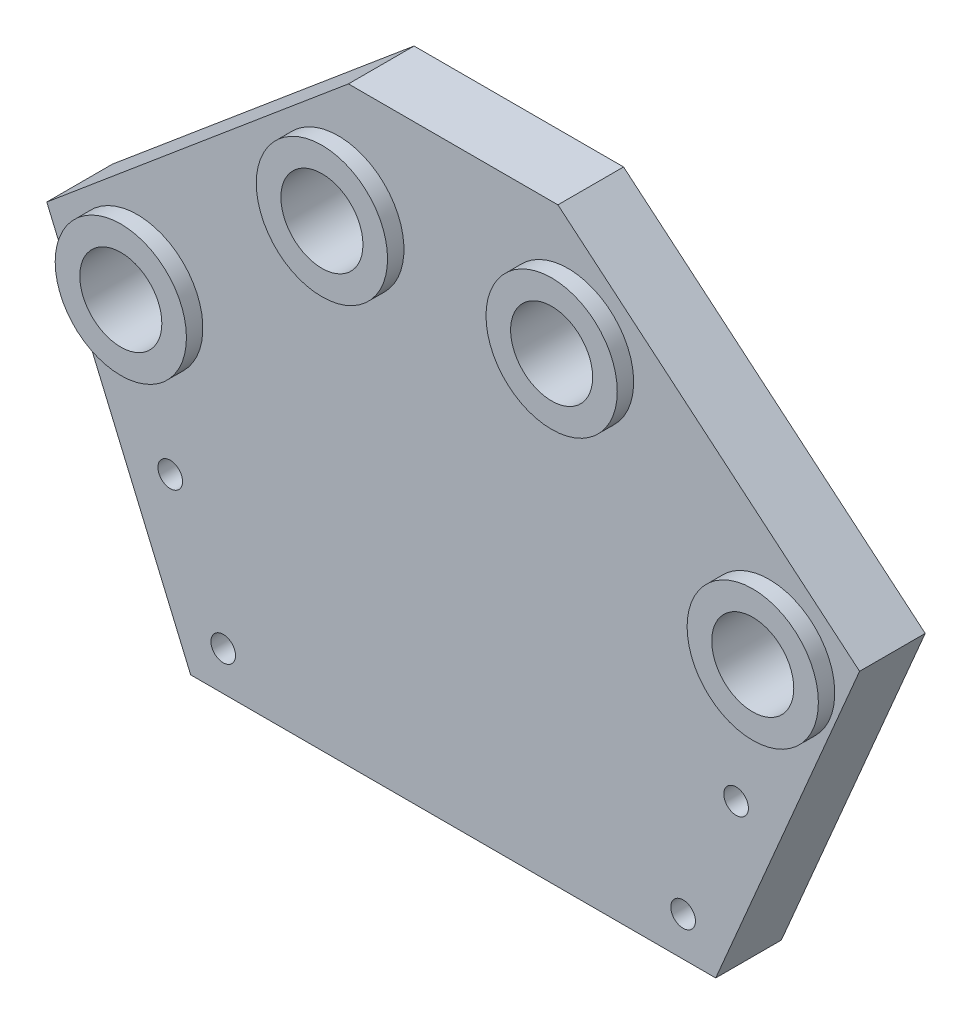
ISO-10303-21;
HEADER;
FILE_DESCRIPTION(('STEP AP214'),'2;1');
FILE_NAME('part.step','',(''),(''),'','','');
FILE_SCHEMA(('AUTOMOTIVE_DESIGN { 1 0 10303 214 1 1 1 1 }'));
ENDSEC;
DATA;
#1=APPLICATION_CONTEXT('core data for automotive mechanical design processes');
#2=APPLICATION_PROTOCOL_DEFINITION('international standard','automotive_design',2000,#1);
#3=PRODUCT_CONTEXT('',#1,'mechanical');
#4=PRODUCT('Part','Part','',(#3));
#5=PRODUCT_RELATED_PRODUCT_CATEGORY('part','',(#4));
#6=PRODUCT_DEFINITION_FORMATION('','',#4);
#7=PRODUCT_DEFINITION_CONTEXT('part definition',#1,'design');
#8=PRODUCT_DEFINITION('design','',#6,#7);
#9=PRODUCT_DEFINITION_SHAPE('','',#8);
#10=(LENGTH_UNIT() NAMED_UNIT(*) SI_UNIT(.MILLI.,.METRE.));
#11=(NAMED_UNIT(*) PLANE_ANGLE_UNIT() SI_UNIT($,.RADIAN.));
#12=(NAMED_UNIT(*) SI_UNIT($,.STERADIAN.) SOLID_ANGLE_UNIT());
#13=UNCERTAINTY_MEASURE_WITH_UNIT(LENGTH_MEASURE(1.E-05),#10,'distance_accuracy_value','');
#14=(GEOMETRIC_REPRESENTATION_CONTEXT(3) GLOBAL_UNCERTAINTY_ASSIGNED_CONTEXT((#13)) GLOBAL_UNIT_ASSIGNED_CONTEXT((#10,
#11,#12)) REPRESENTATION_CONTEXT('',''));
#15=CARTESIAN_POINT('',(0.,0.,0.));
#16=DIRECTION('',(0.,0.,1.));
#17=DIRECTION('',(1.,0.,0.));
#18=AXIS2_PLACEMENT_3D('',#15,#16,#17);
#19=CARTESIAN_POINT('',(0.,0.,6.35));
#20=DIRECTION('',(0.,0.,-1.));
#21=DIRECTION('',(-1.,0.,0.));
#22=AXIS2_PLACEMENT_3D('',#19,#20,#21);
#23=PLANE('',#22);
#24=CARTESIAN_POINT('',(-30.5700288552221,29.6405902948182,6.35));
#25=DIRECTION('',(0.,0.,-1.));
#26=DIRECTION('',(-1.,0.,0.));
#27=AXIS2_PLACEMENT_3D('',#24,#25,#26);
#28=CIRCLE('',#27,6.35);
#29=CARTESIAN_POINT('',(-36.9200288552221,29.6405902948182,6.35));
#30=VERTEX_POINT('',#29);
#31=EDGE_CURVE('E43',#30,#30,#28,.F.);
#32=ORIENTED_EDGE('',*,*,#31,.F.);
#33=EDGE_LOOP('',(#32));
#34=FACE_BOUND('',#33,.T.);
#35=CARTESIAN_POINT('',(-11.1125,45.9673955808562,6.35));
#36=DIRECTION('',(0.,0.,-1.));
#37=DIRECTION('',(-1.,0.,0.));
#38=AXIS2_PLACEMENT_3D('',#35,#36,#37);
#39=CIRCLE('',#38,6.35);
#40=CARTESIAN_POINT('',(-17.4625,45.9673955808562,6.35));
#41=VERTEX_POINT('',#40);
#42=EDGE_CURVE('E140',#41,#41,#39,.F.);
#43=ORIENTED_EDGE('',*,*,#42,.F.);
#44=EDGE_LOOP('',(#43));
#45=FACE_BOUND('',#44,.T.);
#46=CARTESIAN_POINT('',(27.374737278154,15.806737026746,6.35));
#47=DIRECTION('',(0.,0.,-1.));
#48=DIRECTION('',(-1.,0.,0.));
#49=AXIS2_PLACEMENT_3D('',#46,#47,#48);
#50=CIRCLE('',#49,1.190625);
#51=CARTESIAN_POINT('',(26.184112278154,15.806737026746,6.35));
#52=VERTEX_POINT('',#51);
#53=EDGE_CURVE('E159',#52,#52,#50,.F.);
#54=ORIENTED_EDGE('',*,*,#53,.F.);
#55=EDGE_LOOP('',(#54));
#56=FACE_BOUND('',#55,.T.);
#57=CARTESIAN_POINT('',(22.2484937336883,3.77967306906618,6.35));
#58=DIRECTION('',(0.,0.,-1.));
#59=DIRECTION('',(-1.,0.,0.));
#60=AXIS2_PLACEMENT_3D('',#57,#58,#59);
#61=CIRCLE('',#60,1.190625);
#62=CARTESIAN_POINT('',(21.0578687336883,3.77967306906618,6.35));
#63=VERTEX_POINT('',#62);
#64=EDGE_CURVE('E163',#63,#63,#61,.F.);
#65=ORIENTED_EDGE('',*,*,#64,.F.);
#66=EDGE_LOOP('',(#65));
#67=FACE_BOUND('',#66,.T.);
#68=CARTESIAN_POINT('',(-22.2484937336883,3.77967306906618,6.35));
#69=DIRECTION('',(0.,0.,-1.));
#70=DIRECTION('',(-1.,0.,0.));
#71=AXIS2_PLACEMENT_3D('',#68,#69,#70);
#72=CIRCLE('',#71,1.190625);
#73=CARTESIAN_POINT('',(-23.4391187336883,3.77967306906618,6.35));
#74=VERTEX_POINT('',#73);
#75=EDGE_CURVE('E167',#74,#74,#72,.F.);
#76=ORIENTED_EDGE('',*,*,#75,.F.);
#77=EDGE_LOOP('',(#76));
#78=FACE_BOUND('',#77,.T.);
#79=CARTESIAN_POINT('',(-27.374737278154,15.806737026746,6.35));
#80=DIRECTION('',(0.,0.,-1.));
#81=DIRECTION('',(-1.,0.,0.));
#82=AXIS2_PLACEMENT_3D('',#79,#80,#81);
#83=CIRCLE('',#82,1.190625);
#84=CARTESIAN_POINT('',(-28.565362278154,15.806737026746,6.35));
#85=VERTEX_POINT('',#84);
#86=EDGE_CURVE('E170',#85,#85,#83,.F.);
#87=ORIENTED_EDGE('',*,*,#86,.F.);
#88=EDGE_LOOP('',(#87));
#89=FACE_BOUND('',#88,.T.);
#90=DIRECTION('',(-0.766044443118982,0.642787609686535,0.));
#91=VECTOR('',#90,1.);
#92=CARTESIAN_POINT('',(39.3204421674631,32.659792070943,6.35));
#93=LINE('',#92,#91);
#94=CARTESIAN_POINT('',(39.3204421674631,32.659792070943,6.35));
#95=VERTEX_POINT('',#94);
#96=CARTESIAN_POINT('',(10.13414888463,57.15,6.35));
#97=VERTEX_POINT('',#96);
#98=EDGE_CURVE('E131',#95,#97,#93,.T.);
#99=ORIENTED_EDGE('',*,*,#98,.T.);
#100=DIRECTION('',(-1.,0.,0.));
#101=VECTOR('',#100,1.);
#102=CARTESIAN_POINT('',(10.13414888463,57.15,6.35));
#103=LINE('',#102,#101);
#104=CARTESIAN_POINT('',(-10.13414888463,57.15,6.35));
#105=VERTEX_POINT('',#104);
#106=EDGE_CURVE('E89',#97,#105,#103,.T.);
#107=ORIENTED_EDGE('',*,*,#106,.T.);
#108=DIRECTION('',(-0.766044443118982,-0.642787609686535,0.));
#109=VECTOR('',#108,1.);
#110=CARTESIAN_POINT('',(-39.3204421674631,32.659792070943,6.35));
#111=LINE('',#110,#109);
#112=CARTESIAN_POINT('',(-39.3204421674631,32.659792070943,6.35));
#113=VERTEX_POINT('',#112);
#114=EDGE_CURVE('E102',#105,#113,#111,.T.);
#115=ORIENTED_EDGE('',*,*,#114,.T.);
#116=DIRECTION('',(0.392095462422468,-0.919924534050327,0.));
#117=VECTOR('',#116,1.);
#118=CARTESIAN_POINT('',(-25.4,0.,6.35));
#119=LINE('',#118,#117);
#120=CARTESIAN_POINT('',(-25.4,0.,6.35));
#121=VERTEX_POINT('',#120);
#122=EDGE_CURVE('E96',#113,#121,#119,.T.);
#123=ORIENTED_EDGE('',*,*,#122,.T.);
#124=DIRECTION('',(1.,0.,0.));
#125=VECTOR('',#124,1.);
#126=CARTESIAN_POINT('',(-25.4,0.,6.35));
#127=LINE('',#126,#125);
#128=CARTESIAN_POINT('',(25.4,0.,6.35));
#129=VERTEX_POINT('',#128);
#130=EDGE_CURVE('E100',#121,#129,#127,.T.);
#131=ORIENTED_EDGE('',*,*,#130,.T.);
#132=DIRECTION('',(0.392095462422468,0.919924534050327,0.));
#133=VECTOR('',#132,1.);
#134=CARTESIAN_POINT('',(25.4,0.,6.35));
#135=LINE('',#134,#133);
#136=EDGE_CURVE('E51',#129,#95,#135,.T.);
#137=ORIENTED_EDGE('',*,*,#136,.T.);
#138=EDGE_LOOP('',(#99,#107,#115,#123,#131,#137));
#139=FACE_BOUND('',#138,.T.);
#140=CARTESIAN_POINT('',(11.1125,45.9673955808562,6.35));
#141=DIRECTION('',(0.,0.,-1.));
#142=DIRECTION('',(-1.,0.,0.));
#143=AXIS2_PLACEMENT_3D('',#140,#141,#142);
#144=CIRCLE('',#143,6.35);
#145=CARTESIAN_POINT('',(4.76249999999999,45.9673955808562,6.35));
#146=VERTEX_POINT('',#145);
#147=EDGE_CURVE('E143',#146,#146,#144,.F.);
#148=ORIENTED_EDGE('',*,*,#147,.F.);
#149=EDGE_LOOP('',(#148));
#150=FACE_BOUND('',#149,.T.);
#151=CARTESIAN_POINT('',(30.5700288552221,29.6405902948182,6.35));
#152=DIRECTION('',(0.,0.,-1.));
#153=DIRECTION('',(-1.,0.,0.));
#154=AXIS2_PLACEMENT_3D('',#151,#152,#153);
#155=CIRCLE('',#154,6.35);
#156=CARTESIAN_POINT('',(24.2200288552221,29.6405902948182,6.35));
#157=VERTEX_POINT('',#156);
#158=EDGE_CURVE('E11',#157,#157,#155,.F.);
#159=ORIENTED_EDGE('',*,*,#158,.F.);
#160=EDGE_LOOP('',(#159));
#161=FACE_BOUND('',#160,.T.);
#162=ADVANCED_FACE('F34',(#34,#45,#56,#67,#78,#89,#139,#150,#161),#23,.F.);
#163=CARTESIAN_POINT('',(0.,0.,0.));
#164=DIRECTION('',(0.,0.,-1.));
#165=DIRECTION('',(-1.,0.,0.));
#166=AXIS2_PLACEMENT_3D('',#163,#164,#165);
#167=PLANE('',#166);
#168=CARTESIAN_POINT('',(27.374737278154,15.806737026746,0.));
#169=DIRECTION('',(0.,0.,-1.));
#170=DIRECTION('',(-1.,0.,0.));
#171=AXIS2_PLACEMENT_3D('',#168,#169,#170);
#172=CIRCLE('',#171,1.190625);
#173=CARTESIAN_POINT('',(26.184112278154,15.806737026746,0.));
#174=VERTEX_POINT('',#173);
#175=EDGE_CURVE('E234',#174,#174,#172,.T.);
#176=ORIENTED_EDGE('',*,*,#175,.F.);
#177=EDGE_LOOP('',(#176));
#178=FACE_BOUND('',#177,.T.);
#179=CARTESIAN_POINT('',(22.2484937336883,3.77967306906618,0.));
#180=DIRECTION('',(0.,0.,-1.));
#181=DIRECTION('',(-1.,0.,0.));
#182=AXIS2_PLACEMENT_3D('',#179,#180,#181);
#183=CIRCLE('',#182,1.190625);
#184=CARTESIAN_POINT('',(21.0578687336883,3.77967306906618,0.));
#185=VERTEX_POINT('',#184);
#186=EDGE_CURVE('E238',#185,#185,#183,.T.);
#187=ORIENTED_EDGE('',*,*,#186,.F.);
#188=EDGE_LOOP('',(#187));
#189=FACE_BOUND('',#188,.T.);
#190=CARTESIAN_POINT('',(-22.2484937336883,3.77967306906618,0.));
#191=DIRECTION('',(0.,0.,-1.));
#192=DIRECTION('',(1.,0.,0.));
#193=AXIS2_PLACEMENT_3D('',#190,#191,#192);
#194=CIRCLE('',#193,1.190625);
#195=CARTESIAN_POINT('',(-21.0578687336883,3.77967306906618,0.));
#196=VERTEX_POINT('',#195);
#197=EDGE_CURVE('E172',#196,#196,#194,.T.);
#198=ORIENTED_EDGE('',*,*,#197,.F.);
#199=EDGE_LOOP('',(#198));
#200=FACE_BOUND('',#199,.T.);
#201=CARTESIAN_POINT('',(-27.374737278154,15.806737026746,0.));
#202=DIRECTION('',(0.,0.,-1.));
#203=DIRECTION('',(1.,0.,0.));
#204=AXIS2_PLACEMENT_3D('',#201,#202,#203);
#205=CIRCLE('',#204,1.190625);
#206=CARTESIAN_POINT('',(-26.184112278154,15.806737026746,0.));
#207=VERTEX_POINT('',#206);
#208=EDGE_CURVE('E173',#207,#207,#205,.T.);
#209=ORIENTED_EDGE('',*,*,#208,.F.);
#210=EDGE_LOOP('',(#209));
#211=FACE_BOUND('',#210,.T.);
#212=CARTESIAN_POINT('',(30.5700288552221,29.6405902948182,0.));
#213=DIRECTION('',(0.,0.,1.));
#214=DIRECTION('',(1.,0.,0.));
#215=AXIS2_PLACEMENT_3D('',#212,#213,#214);
#216=CIRCLE('',#215,3.96875);
#217=CARTESIAN_POINT('',(34.5387788552221,29.6405902948182,0.));
#218=VERTEX_POINT('',#217);
#219=EDGE_CURVE('E185',#218,#218,#216,.T.);
#220=ORIENTED_EDGE('',*,*,#219,.T.);
#221=EDGE_LOOP('',(#220));
#222=FACE_BOUND('',#221,.T.);
#223=CARTESIAN_POINT('',(11.1125,45.9673955808562,0.));
#224=DIRECTION('',(0.,0.,1.));
#225=DIRECTION('',(1.,0.,0.));
#226=AXIS2_PLACEMENT_3D('',#223,#224,#225);
#227=CIRCLE('',#226,3.96875);
#228=CARTESIAN_POINT('',(15.08125,45.9673955808562,0.));
#229=VERTEX_POINT('',#228);
#230=EDGE_CURVE('E124',#229,#229,#227,.T.);
#231=ORIENTED_EDGE('',*,*,#230,.T.);
#232=EDGE_LOOP('',(#231));
#233=FACE_BOUND('',#232,.T.);
#234=DIRECTION('',(-0.766044443118982,0.642787609686535,0.));
#235=VECTOR('',#234,1.);
#236=CARTESIAN_POINT('',(39.3204421674631,32.659792070943,0.));
#237=LINE('',#236,#235);
#238=CARTESIAN_POINT('',(39.3204421674631,32.659792070943,0.));
#239=VERTEX_POINT('',#238);
#240=CARTESIAN_POINT('',(10.13414888463,57.15,0.));
#241=VERTEX_POINT('',#240);
#242=EDGE_CURVE('E120',#239,#241,#237,.T.);
#243=ORIENTED_EDGE('',*,*,#242,.F.);
#244=DIRECTION('',(0.392095462422468,0.919924534050327,0.));
#245=VECTOR('',#244,1.);
#246=CARTESIAN_POINT('',(25.4,0.,0.));
#247=LINE('',#246,#245);
#248=CARTESIAN_POINT('',(25.4,0.,0.));
#249=VERTEX_POINT('',#248);
#250=EDGE_CURVE('E80',#249,#239,#247,.T.);
#251=ORIENTED_EDGE('',*,*,#250,.F.);
#252=DIRECTION('',(1.,0.,0.));
#253=VECTOR('',#252,1.);
#254=CARTESIAN_POINT('',(-25.4,0.,0.));
#255=LINE('',#254,#253);
#256=CARTESIAN_POINT('',(-25.4,0.,0.));
#257=VERTEX_POINT('',#256);
#258=EDGE_CURVE('E74',#257,#249,#255,.T.);
#259=ORIENTED_EDGE('',*,*,#258,.F.);
#260=DIRECTION('',(0.392095462422468,-0.919924534050327,0.));
#261=VECTOR('',#260,1.);
#262=CARTESIAN_POINT('',(-25.4,0.,0.));
#263=LINE('',#262,#261);
#264=CARTESIAN_POINT('',(-39.3204421674631,32.659792070943,0.));
#265=VERTEX_POINT('',#264);
#266=EDGE_CURVE('E110',#265,#257,#263,.T.);
#267=ORIENTED_EDGE('',*,*,#266,.F.);
#268=DIRECTION('',(-0.766044443118982,-0.642787609686535,0.));
#269=VECTOR('',#268,1.);
#270=CARTESIAN_POINT('',(-39.3204421674631,32.659792070943,0.));
#271=LINE('',#270,#269);
#272=CARTESIAN_POINT('',(-10.13414888463,57.15,0.));
#273=VERTEX_POINT('',#272);
#274=EDGE_CURVE('E126',#273,#265,#271,.T.);
#275=ORIENTED_EDGE('',*,*,#274,.F.);
#276=DIRECTION('',(-1.,0.,0.));
#277=VECTOR('',#276,1.);
#278=CARTESIAN_POINT('',(10.13414888463,57.15,0.));
#279=LINE('',#278,#277);
#280=EDGE_CURVE('E123',#241,#273,#279,.T.);
#281=ORIENTED_EDGE('',*,*,#280,.F.);
#282=EDGE_LOOP('',(#243,#251,#259,#267,#275,#281));
#283=FACE_BOUND('',#282,.T.);
#284=CARTESIAN_POINT('',(-11.1125,45.9673955808562,0.));
#285=DIRECTION('',(0.,0.,1.));
#286=DIRECTION('',(-1.,0.,0.));
#287=AXIS2_PLACEMENT_3D('',#284,#285,#286);
#288=CIRCLE('',#287,3.96875);
#289=CARTESIAN_POINT('',(-15.08125,45.9673955808562,0.));
#290=VERTEX_POINT('',#289);
#291=EDGE_CURVE('E188',#290,#290,#288,.T.);
#292=ORIENTED_EDGE('',*,*,#291,.T.);
#293=EDGE_LOOP('',(#292));
#294=FACE_BOUND('',#293,.T.);
#295=CARTESIAN_POINT('',(-30.5700288552221,29.6405902948182,0.));
#296=DIRECTION('',(0.,0.,1.));
#297=DIRECTION('',(-1.,0.,0.));
#298=AXIS2_PLACEMENT_3D('',#295,#296,#297);
#299=CIRCLE('',#298,3.96875);
#300=CARTESIAN_POINT('',(-34.5387788552221,29.6405902948182,0.));
#301=VERTEX_POINT('',#300);
#302=EDGE_CURVE('E182',#301,#301,#299,.T.);
#303=ORIENTED_EDGE('',*,*,#302,.T.);
#304=EDGE_LOOP('',(#303));
#305=FACE_BOUND('',#304,.T.);
#306=ADVANCED_FACE('F152',(#178,#189,#200,#211,#222,#233,#283,#294,#305),#167,.T.);
#307=CARTESIAN_POINT('',(39.3204421674631,32.659792070943,6.35));
#308=DIRECTION('',(-0.642787609686535,-0.766044443118982,0.));
#309=DIRECTION('',(0.766044443118982,-0.642787609686535,0.));
#310=AXIS2_PLACEMENT_3D('',#307,#308,#309);
#311=PLANE('',#310);
#312=ORIENTED_EDGE('',*,*,#242,.T.);
#313=DIRECTION('',(0.,0.,-1.));
#314=VECTOR('',#313,1.);
#315=CARTESIAN_POINT('',(10.13414888463,57.15,6.35));
#316=LINE('',#315,#314);
#317=EDGE_CURVE('E138',#97,#241,#316,.T.);
#318=ORIENTED_EDGE('',*,*,#317,.F.);
#319=ORIENTED_EDGE('',*,*,#98,.F.);
#320=DIRECTION('',(0.,0.,-1.));
#321=VECTOR('',#320,1.);
#322=CARTESIAN_POINT('',(39.3204421674631,32.659792070943,6.35));
#323=LINE('',#322,#321);
#324=EDGE_CURVE('E116',#95,#239,#323,.T.);
#325=ORIENTED_EDGE('',*,*,#324,.T.);
#326=EDGE_LOOP('',(#312,#318,#319,#325));
#327=FACE_BOUND('',#326,.T.);
#328=ADVANCED_FACE('F36',(#327),#311,.F.);
#329=CARTESIAN_POINT('',(10.13414888463,57.15,6.35));
#330=DIRECTION('',(0.,-1.,0.));
#331=DIRECTION('',(0.,0.,-1.));
#332=AXIS2_PLACEMENT_3D('',#329,#330,#331);
#333=PLANE('',#332);
#334=ORIENTED_EDGE('',*,*,#280,.T.);
#335=DIRECTION('',(0.,0.,-1.));
#336=VECTOR('',#335,1.);
#337=CARTESIAN_POINT('',(-10.13414888463,57.15,6.35));
#338=LINE('',#337,#336);
#339=EDGE_CURVE('E135',#105,#273,#338,.T.);
#340=ORIENTED_EDGE('',*,*,#339,.F.);
#341=ORIENTED_EDGE('',*,*,#106,.F.);
#342=ORIENTED_EDGE('',*,*,#317,.T.);
#343=EDGE_LOOP('',(#334,#340,#341,#342));
#344=FACE_BOUND('',#343,.T.);
#345=ADVANCED_FACE('F196',(#344),#333,.F.);
#346=CARTESIAN_POINT('',(-39.3204421674631,32.659792070943,6.35));
#347=DIRECTION('',(0.642787609686535,-0.766044443118982,0.));
#348=DIRECTION('',(0.766044443118982,0.642787609686535,0.));
#349=AXIS2_PLACEMENT_3D('',#346,#347,#348);
#350=PLANE('',#349);
#351=ORIENTED_EDGE('',*,*,#274,.T.);
#352=DIRECTION('',(0.,0.,-1.));
#353=VECTOR('',#352,1.);
#354=CARTESIAN_POINT('',(-39.3204421674631,32.659792070943,6.35));
#355=LINE('',#354,#353);
#356=EDGE_CURVE('E111',#113,#265,#355,.T.);
#357=ORIENTED_EDGE('',*,*,#356,.F.);
#358=ORIENTED_EDGE('',*,*,#114,.F.);
#359=ORIENTED_EDGE('',*,*,#339,.T.);
#360=EDGE_LOOP('',(#351,#357,#358,#359));
#361=FACE_BOUND('',#360,.T.);
#362=ADVANCED_FACE('F199',(#361),#350,.F.);
#363=CARTESIAN_POINT('',(-25.4,0.,6.35));
#364=DIRECTION('',(0.919924534050327,0.392095462422468,0.));
#365=DIRECTION('',(-0.392095462422468,0.919924534050327,0.));
#366=AXIS2_PLACEMENT_3D('',#363,#364,#365);
#367=PLANE('',#366);
#368=ORIENTED_EDGE('',*,*,#266,.T.);
#369=DIRECTION('',(0.,0.,-1.));
#370=VECTOR('',#369,1.);
#371=CARTESIAN_POINT('',(-25.4,0.,6.35));
#372=LINE('',#371,#370);
#373=EDGE_CURVE('E107',#121,#257,#372,.T.);
#374=ORIENTED_EDGE('',*,*,#373,.F.);
#375=ORIENTED_EDGE('',*,*,#122,.F.);
#376=ORIENTED_EDGE('',*,*,#356,.T.);
#377=EDGE_LOOP('',(#368,#374,#375,#376));
#378=FACE_BOUND('',#377,.T.);
#379=ADVANCED_FACE('F108',(#378),#367,.F.);
#380=CARTESIAN_POINT('',(-25.4,0.,6.35));
#381=DIRECTION('',(0.,1.,0.));
#382=DIRECTION('',(0.,0.,1.));
#383=AXIS2_PLACEMENT_3D('',#380,#381,#382);
#384=PLANE('',#383);
#385=ORIENTED_EDGE('',*,*,#258,.T.);
#386=DIRECTION('',(0.,0.,-1.));
#387=VECTOR('',#386,1.);
#388=CARTESIAN_POINT('',(25.4,0.,6.35));
#389=LINE('',#388,#387);
#390=EDGE_CURVE('E112',#129,#249,#389,.T.);
#391=ORIENTED_EDGE('',*,*,#390,.F.);
#392=ORIENTED_EDGE('',*,*,#130,.F.);
#393=ORIENTED_EDGE('',*,*,#373,.T.);
#394=EDGE_LOOP('',(#385,#391,#392,#393));
#395=FACE_BOUND('',#394,.T.);
#396=ADVANCED_FACE('F114',(#395),#384,.F.);
#397=CARTESIAN_POINT('',(25.4,0.,6.35));
#398=DIRECTION('',(-0.919924534050327,0.392095462422468,0.));
#399=DIRECTION('',(-0.392095462422468,-0.919924534050327,0.));
#400=AXIS2_PLACEMENT_3D('',#397,#398,#399);
#401=PLANE('',#400);
#402=ORIENTED_EDGE('',*,*,#250,.T.);
#403=ORIENTED_EDGE('',*,*,#324,.F.);
#404=ORIENTED_EDGE('',*,*,#136,.F.);
#405=ORIENTED_EDGE('',*,*,#390,.T.);
#406=EDGE_LOOP('',(#402,#403,#404,#405));
#407=FACE_BOUND('',#406,.T.);
#408=ADVANCED_FACE('F204',(#407),#401,.F.);
#409=CARTESIAN_POINT('',(11.1125,45.9673955808562,6.35));
#410=DIRECTION('',(0.,0.,-1.));
#411=DIRECTION('',(-1.,0.,0.));
#412=AXIS2_PLACEMENT_3D('',#409,#410,#411);
#413=CYLINDRICAL_SURFACE('',#412,3.96875);
#414=ORIENTED_EDGE('',*,*,#230,.F.);
#415=EDGE_LOOP('',(#414));
#416=FACE_BOUND('',#415,.T.);
#417=CARTESIAN_POINT('',(11.1125,45.9673955808562,7.9375));
#418=DIRECTION('',(0.,0.,1.));
#419=DIRECTION('',(1.,0.,0.));
#420=AXIS2_PLACEMENT_3D('',#417,#418,#419);
#421=CIRCLE('',#420,3.96875);
#422=CARTESIAN_POINT('',(15.08125,45.9673955808562,7.9375));
#423=VERTEX_POINT('',#422);
#424=EDGE_CURVE('E249',#423,#423,#421,.T.);
#425=ORIENTED_EDGE('',*,*,#424,.T.);
#426=EDGE_LOOP('',(#425));
#427=FACE_BOUND('',#426,.T.);
#428=ADVANCED_FACE('F206',(#416,#427),#413,.F.);
#429=CARTESIAN_POINT('',(-11.1125,45.9673955808562,6.35));
#430=DIRECTION('',(0.,0.,-1.));
#431=DIRECTION('',(-1.,0.,0.));
#432=AXIS2_PLACEMENT_3D('',#429,#430,#431);
#433=CYLINDRICAL_SURFACE('',#432,3.96875);
#434=ORIENTED_EDGE('',*,*,#291,.F.);
#435=EDGE_LOOP('',(#434));
#436=FACE_BOUND('',#435,.T.);
#437=CARTESIAN_POINT('',(-11.1125,45.9673955808562,7.9375));
#438=DIRECTION('',(0.,0.,1.));
#439=DIRECTION('',(1.,0.,0.));
#440=AXIS2_PLACEMENT_3D('',#437,#438,#439);
#441=CIRCLE('',#440,3.96875);
#442=CARTESIAN_POINT('',(-7.14374999999999,45.9673955808562,7.9375));
#443=VERTEX_POINT('',#442);
#444=EDGE_CURVE('E255',#443,#443,#441,.T.);
#445=ORIENTED_EDGE('',*,*,#444,.T.);
#446=EDGE_LOOP('',(#445));
#447=FACE_BOUND('',#446,.T.);
#448=ADVANCED_FACE('F212',(#436,#447),#433,.F.);
#449=CARTESIAN_POINT('',(30.5700288552221,29.6405902948182,6.35));
#450=DIRECTION('',(0.,0.,-1.));
#451=DIRECTION('',(-1.,0.,0.));
#452=AXIS2_PLACEMENT_3D('',#449,#450,#451);
#453=CYLINDRICAL_SURFACE('',#452,3.96875);
#454=ORIENTED_EDGE('',*,*,#219,.F.);
#455=EDGE_LOOP('',(#454));
#456=FACE_BOUND('',#455,.T.);
#457=CARTESIAN_POINT('',(30.5700288552221,29.6405902948182,7.9375));
#458=DIRECTION('',(0.,0.,1.));
#459=DIRECTION('',(1.,0.,0.));
#460=AXIS2_PLACEMENT_3D('',#457,#458,#459);
#461=CIRCLE('',#460,3.96875);
#462=CARTESIAN_POINT('',(34.5387788552221,29.6405902948182,7.9375));
#463=VERTEX_POINT('',#462);
#464=EDGE_CURVE('E345',#463,#463,#461,.T.);
#465=ORIENTED_EDGE('',*,*,#464,.T.);
#466=EDGE_LOOP('',(#465));
#467=FACE_BOUND('',#466,.T.);
#468=ADVANCED_FACE('F289',(#456,#467),#453,.F.);
#469=CARTESIAN_POINT('',(-30.5700288552221,29.6405902948182,6.35));
#470=DIRECTION('',(0.,0.,-1.));
#471=DIRECTION('',(-1.,0.,0.));
#472=AXIS2_PLACEMENT_3D('',#469,#470,#471);
#473=CYLINDRICAL_SURFACE('',#472,3.96875);
#474=ORIENTED_EDGE('',*,*,#302,.F.);
#475=EDGE_LOOP('',(#474));
#476=FACE_BOUND('',#475,.T.);
#477=CARTESIAN_POINT('',(-30.5700288552221,29.6405902948182,7.9375));
#478=DIRECTION('',(0.,0.,1.));
#479=DIRECTION('',(1.,0.,0.));
#480=AXIS2_PLACEMENT_3D('',#477,#478,#479);
#481=CIRCLE('',#480,3.96875000000001);
#482=CARTESIAN_POINT('',(-26.6012788552221,29.6405902948182,7.9375));
#483=VERTEX_POINT('',#482);
#484=EDGE_CURVE('E258',#483,#483,#481,.T.);
#485=ORIENTED_EDGE('',*,*,#484,.T.);
#486=EDGE_LOOP('',(#485));
#487=FACE_BOUND('',#486,.T.);
#488=ADVANCED_FACE('F283',(#476,#487),#473,.F.);
#489=CARTESIAN_POINT('',(-27.374737278154,15.806737026746,9.71759604540093));
#490=DIRECTION('',(0.,0.,-1.));
#491=DIRECTION('',(-1.,0.,0.));
#492=AXIS2_PLACEMENT_3D('',#489,#490,#491);
#493=CYLINDRICAL_SURFACE('',#492,1.190625);
#494=ORIENTED_EDGE('',*,*,#86,.T.);
#495=EDGE_LOOP('',(#494));
#496=FACE_BOUND('',#495,.T.);
#497=ORIENTED_EDGE('',*,*,#208,.T.);
#498=EDGE_LOOP('',(#497));
#499=FACE_BOUND('',#498,.T.);
#500=ADVANCED_FACE('F274',(#496,#499),#493,.F.);
#501=CARTESIAN_POINT('',(-22.2484937336883,3.77967306906618,9.71759604540093));
#502=DIRECTION('',(0.,0.,-1.));
#503=DIRECTION('',(-1.,0.,0.));
#504=AXIS2_PLACEMENT_3D('',#501,#502,#503);
#505=CYLINDRICAL_SURFACE('',#504,1.190625);
#506=ORIENTED_EDGE('',*,*,#75,.T.);
#507=EDGE_LOOP('',(#506));
#508=FACE_BOUND('',#507,.T.);
#509=ORIENTED_EDGE('',*,*,#197,.T.);
#510=EDGE_LOOP('',(#509));
#511=FACE_BOUND('',#510,.T.);
#512=ADVANCED_FACE('F270',(#508,#511),#505,.F.);
#513=CARTESIAN_POINT('',(22.2484937336883,3.77967306906618,9.71759604540093));
#514=DIRECTION('',(0.,0.,-1.));
#515=DIRECTION('',(-1.,0.,0.));
#516=AXIS2_PLACEMENT_3D('',#513,#514,#515);
#517=CYLINDRICAL_SURFACE('',#516,1.190625);
#518=ORIENTED_EDGE('',*,*,#64,.T.);
#519=EDGE_LOOP('',(#518));
#520=FACE_BOUND('',#519,.T.);
#521=ORIENTED_EDGE('',*,*,#186,.T.);
#522=EDGE_LOOP('',(#521));
#523=FACE_BOUND('',#522,.T.);
#524=ADVANCED_FACE('F273',(#520,#523),#517,.F.);
#525=CARTESIAN_POINT('',(27.374737278154,15.806737026746,9.71759604540093));
#526=DIRECTION('',(0.,0.,-1.));
#527=DIRECTION('',(-1.,0.,0.));
#528=AXIS2_PLACEMENT_3D('',#525,#526,#527);
#529=CYLINDRICAL_SURFACE('',#528,1.190625);
#530=ORIENTED_EDGE('',*,*,#53,.T.);
#531=EDGE_LOOP('',(#530));
#532=FACE_BOUND('',#531,.T.);
#533=ORIENTED_EDGE('',*,*,#175,.T.);
#534=EDGE_LOOP('',(#533));
#535=FACE_BOUND('',#534,.T.);
#536=ADVANCED_FACE('F280',(#532,#535),#529,.F.);
#537=CARTESIAN_POINT('',(-11.1125,45.9673955808562,7.9375));
#538=DIRECTION('',(0.,0.,1.));
#539=DIRECTION('',(1.,0.,0.));
#540=AXIS2_PLACEMENT_3D('',#537,#538,#539);
#541=PLANE('',#540);
#542=CARTESIAN_POINT('',(-11.1125,45.9673955808562,7.9375));
#543=DIRECTION('',(0.,0.,1.));
#544=DIRECTION('',(1.,0.,0.));
#545=AXIS2_PLACEMENT_3D('',#542,#543,#544);
#546=CIRCLE('',#545,6.35);
#547=CARTESIAN_POINT('',(-4.7625,45.9673955808562,7.9375));
#548=VERTEX_POINT('',#547);
#549=EDGE_CURVE('E178',#548,#548,#546,.T.);
#550=ORIENTED_EDGE('',*,*,#549,.T.);
#551=EDGE_LOOP('',(#550));
#552=FACE_BOUND('',#551,.T.);
#553=ORIENTED_EDGE('',*,*,#444,.F.);
#554=EDGE_LOOP('',(#553));
#555=FACE_BOUND('',#554,.T.);
#556=ADVANCED_FACE('F302',(#552,#555),#541,.T.);
#557=CARTESIAN_POINT('',(-11.1125,45.9673955808562,7.9375));
#558=DIRECTION('',(0.,0.,-1.));
#559=DIRECTION('',(-1.,0.,0.));
#560=AXIS2_PLACEMENT_3D('',#557,#558,#559);
#561=CYLINDRICAL_SURFACE('',#560,6.35);
#562=ORIENTED_EDGE('',*,*,#549,.F.);
#563=EDGE_LOOP('',(#562));
#564=FACE_BOUND('',#563,.T.);
#565=ORIENTED_EDGE('',*,*,#42,.T.);
#566=EDGE_LOOP('',(#565));
#567=FACE_BOUND('',#566,.T.);
#568=ADVANCED_FACE('F304',(#564,#567),#561,.T.);
#569=CARTESIAN_POINT('',(11.1125,45.9673955808562,7.9375));
#570=DIRECTION('',(0.,0.,1.));
#571=DIRECTION('',(1.,0.,0.));
#572=AXIS2_PLACEMENT_3D('',#569,#570,#571);
#573=PLANE('',#572);
#574=CARTESIAN_POINT('',(11.1125,45.9673955808562,7.9375));
#575=DIRECTION('',(0.,0.,1.));
#576=DIRECTION('',(1.,0.,0.));
#577=AXIS2_PLACEMENT_3D('',#574,#575,#576);
#578=CIRCLE('',#577,6.35);
#579=CARTESIAN_POINT('',(17.4625,45.9673955808562,7.9375));
#580=VERTEX_POINT('',#579);
#581=EDGE_CURVE('E251',#580,#580,#578,.T.);
#582=ORIENTED_EDGE('',*,*,#581,.T.);
#583=EDGE_LOOP('',(#582));
#584=FACE_BOUND('',#583,.T.);
#585=ORIENTED_EDGE('',*,*,#424,.F.);
#586=EDGE_LOOP('',(#585));
#587=FACE_BOUND('',#586,.T.);
#588=ADVANCED_FACE('F311',(#584,#587),#573,.T.);
#589=CARTESIAN_POINT('',(11.1125,45.9673955808562,7.9375));
#590=DIRECTION('',(0.,0.,-1.));
#591=DIRECTION('',(-1.,0.,0.));
#592=AXIS2_PLACEMENT_3D('',#589,#590,#591);
#593=CYLINDRICAL_SURFACE('',#592,6.35);
#594=ORIENTED_EDGE('',*,*,#581,.F.);
#595=EDGE_LOOP('',(#594));
#596=FACE_BOUND('',#595,.T.);
#597=ORIENTED_EDGE('',*,*,#147,.T.);
#598=EDGE_LOOP('',(#597));
#599=FACE_BOUND('',#598,.T.);
#600=ADVANCED_FACE('F316',(#596,#599),#593,.T.);
#601=CARTESIAN_POINT('',(-30.5700288552221,29.6405902948182,7.9375));
#602=DIRECTION('',(0.,0.,1.));
#603=DIRECTION('',(1.,0.,0.));
#604=AXIS2_PLACEMENT_3D('',#601,#602,#603);
#605=PLANE('',#604);
#606=CARTESIAN_POINT('',(-30.5700288552221,29.6405902948182,7.9375));
#607=DIRECTION('',(0.,0.,1.));
#608=DIRECTION('',(1.,0.,0.));
#609=AXIS2_PLACEMENT_3D('',#606,#607,#608);
#610=CIRCLE('',#609,6.35);
#611=CARTESIAN_POINT('',(-24.2200288552221,29.6405902948182,7.9375));
#612=VERTEX_POINT('',#611);
#613=EDGE_CURVE('E252',#612,#612,#610,.T.);
#614=ORIENTED_EDGE('',*,*,#613,.T.);
#615=EDGE_LOOP('',(#614));
#616=FACE_BOUND('',#615,.T.);
#617=ORIENTED_EDGE('',*,*,#484,.F.);
#618=EDGE_LOOP('',(#617));
#619=FACE_BOUND('',#618,.T.);
#620=ADVANCED_FACE('F319',(#616,#619),#605,.T.);
#621=CARTESIAN_POINT('',(-30.5700288552221,29.6405902948182,7.9375));
#622=DIRECTION('',(0.,0.,-1.));
#623=DIRECTION('',(-1.,0.,0.));
#624=AXIS2_PLACEMENT_3D('',#621,#622,#623);
#625=CYLINDRICAL_SURFACE('',#624,6.35);
#626=ORIENTED_EDGE('',*,*,#613,.F.);
#627=EDGE_LOOP('',(#626));
#628=FACE_BOUND('',#627,.T.);
#629=ORIENTED_EDGE('',*,*,#31,.T.);
#630=EDGE_LOOP('',(#629));
#631=FACE_BOUND('',#630,.T.);
#632=ADVANCED_FACE('F148',(#628,#631),#625,.T.);
#633=CARTESIAN_POINT('',(30.5700288552221,29.6405902948182,7.9375));
#634=DIRECTION('',(0.,0.,1.));
#635=DIRECTION('',(1.,0.,0.));
#636=AXIS2_PLACEMENT_3D('',#633,#634,#635);
#637=PLANE('',#636);
#638=CARTESIAN_POINT('',(30.5700288552221,29.6405902948182,7.9375));
#639=DIRECTION('',(0.,0.,1.));
#640=DIRECTION('',(1.,0.,0.));
#641=AXIS2_PLACEMENT_3D('',#638,#639,#640);
#642=CIRCLE('',#641,6.35);
#643=CARTESIAN_POINT('',(36.9200288552221,29.6405902948182,7.9375));
#644=VERTEX_POINT('',#643);
#645=EDGE_CURVE('E342',#644,#644,#642,.T.);
#646=ORIENTED_EDGE('',*,*,#645,.T.);
#647=EDGE_LOOP('',(#646));
#648=FACE_BOUND('',#647,.T.);
#649=ORIENTED_EDGE('',*,*,#464,.F.);
#650=EDGE_LOOP('',(#649));
#651=FACE_BOUND('',#650,.T.);
#652=ADVANCED_FACE('F326',(#648,#651),#637,.T.);
#653=CARTESIAN_POINT('',(30.5700288552221,29.6405902948182,7.9375));
#654=DIRECTION('',(0.,0.,-1.));
#655=DIRECTION('',(-1.,0.,0.));
#656=AXIS2_PLACEMENT_3D('',#653,#654,#655);
#657=CYLINDRICAL_SURFACE('',#656,6.35);
#658=ORIENTED_EDGE('',*,*,#645,.F.);
#659=EDGE_LOOP('',(#658));
#660=FACE_BOUND('',#659,.T.);
#661=ORIENTED_EDGE('',*,*,#158,.T.);
#662=EDGE_LOOP('',(#661));
#663=FACE_BOUND('',#662,.T.);
#664=ADVANCED_FACE('F331',(#660,#663),#657,.T.);
#665=CLOSED_SHELL('',(#162,#306,#328,#345,#362,#379,#396,#408,#428,#448,#468,#488,#500,#512,
#524,#536,#556,#568,#588,#600,#620,#632,#652,#664));
#666=MANIFOLD_SOLID_BREP('B2',#665);
#667=ADVANCED_BREP_SHAPE_REPRESENTATION('',(#18,#666),#14);
#668=SHAPE_DEFINITION_REPRESENTATION(#9,#667);
ENDSEC;
END-ISO-10303-21;
